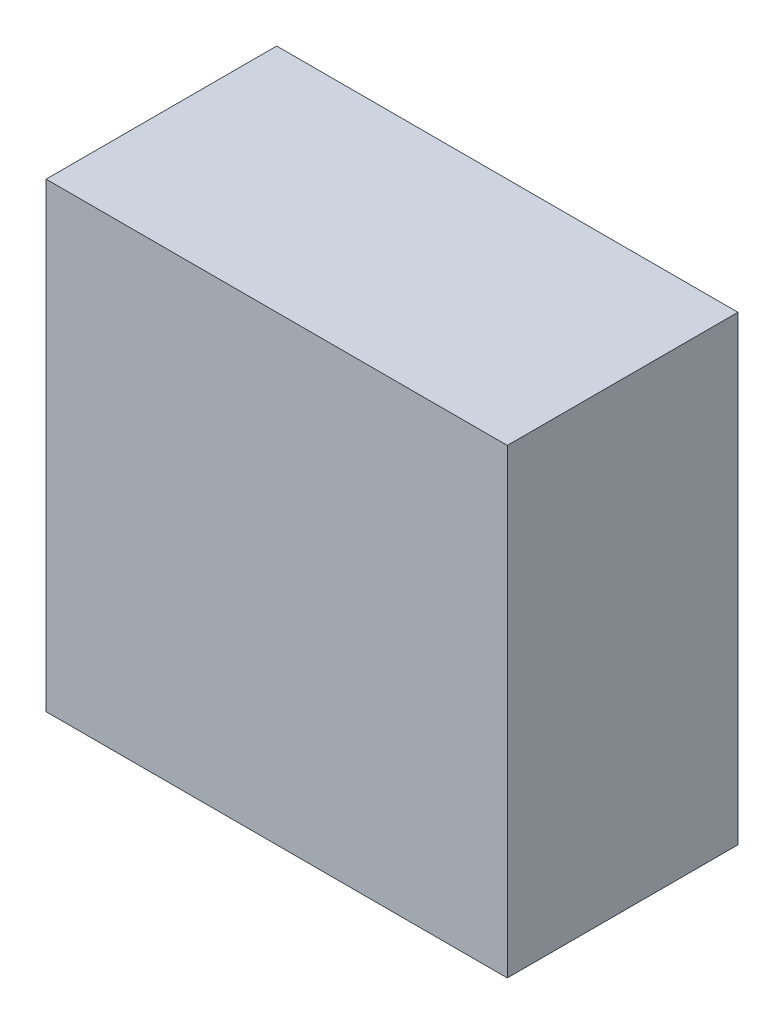
ISO-10303-21;
HEADER;
FILE_DESCRIPTION(('STEP AP214'),'2;1');
FILE_NAME('part.step','',(''),(''),'','','');
FILE_SCHEMA(('AUTOMOTIVE_DESIGN { 1 0 10303 214 1 1 1 1 }'));
ENDSEC;
DATA;
#1=APPLICATION_CONTEXT('core data for automotive mechanical design processes');
#2=APPLICATION_PROTOCOL_DEFINITION('international standard','automotive_design',2000,#1);
#3=PRODUCT_CONTEXT('',#1,'mechanical');
#4=PRODUCT('Part','Part','',(#3));
#5=PRODUCT_RELATED_PRODUCT_CATEGORY('part','',(#4));
#6=PRODUCT_DEFINITION_FORMATION('','',#4);
#7=PRODUCT_DEFINITION_CONTEXT('part definition',#1,'design');
#8=PRODUCT_DEFINITION('design','',#6,#7);
#9=PRODUCT_DEFINITION_SHAPE('','',#8);
#10=(LENGTH_UNIT() NAMED_UNIT(*) SI_UNIT(.MILLI.,.METRE.));
#11=(NAMED_UNIT(*) PLANE_ANGLE_UNIT() SI_UNIT($,.RADIAN.));
#12=(NAMED_UNIT(*) SI_UNIT($,.STERADIAN.) SOLID_ANGLE_UNIT());
#13=UNCERTAINTY_MEASURE_WITH_UNIT(LENGTH_MEASURE(1.E-05),#10,'distance_accuracy_value','');
#14=(GEOMETRIC_REPRESENTATION_CONTEXT(3) GLOBAL_UNCERTAINTY_ASSIGNED_CONTEXT((#13)) GLOBAL_UNIT_ASSIGNED_CONTEXT((#10,
#11,#12)) REPRESENTATION_CONTEXT('',''));
#15=CARTESIAN_POINT('',(0.,0.,0.));
#16=DIRECTION('',(0.,0.,1.));
#17=DIRECTION('',(1.,0.,0.));
#18=AXIS2_PLACEMENT_3D('',#15,#16,#17);
#19=CARTESIAN_POINT('',(0.,0.,2.75));
#20=DIRECTION('',(0.,0.,-1.));
#21=DIRECTION('',(-1.,0.,0.));
#22=AXIS2_PLACEMENT_3D('',#19,#20,#21);
#23=PLANE('',#22);
#24=DIRECTION('',(1.,0.,0.));
#25=VECTOR('',#24,1.);
#26=CARTESIAN_POINT('',(-78.,165.941489418563,2.75));
#27=LINE('',#26,#25);
#28=CARTESIAN_POINT('',(-82.,165.941489418563,2.75));
#29=VERTEX_POINT('',#28);
#30=CARTESIAN_POINT('',(-78.,165.941489418563,2.75));
#31=VERTEX_POINT('',#30);
#32=EDGE_CURVE('E80',#29,#31,#27,.T.);
#33=ORIENTED_EDGE('',*,*,#32,.T.);
#34=DIRECTION('',(0.,1.,0.));
#35=VECTOR('',#34,1.);
#36=CARTESIAN_POINT('',(-78.,169.941489418563,2.75));
#37=LINE('',#36,#35);
#38=CARTESIAN_POINT('',(-78.,169.941489418563,2.75));
#39=VERTEX_POINT('',#38);
#40=EDGE_CURVE('E55',#31,#39,#37,.T.);
#41=ORIENTED_EDGE('',*,*,#40,.T.);
#42=DIRECTION('',(1.,0.,0.));
#43=VECTOR('',#42,1.);
#44=CARTESIAN_POINT('',(-78.,169.941489418563,2.75));
#45=LINE('',#44,#43);
#46=CARTESIAN_POINT('',(-82.,169.941489418563,2.75));
#47=VERTEX_POINT('',#46);
#48=EDGE_CURVE('E57',#39,#47,#45,.F.);
#49=ORIENTED_EDGE('',*,*,#48,.T.);
#50=DIRECTION('',(0.,1.,0.));
#51=VECTOR('',#50,1.);
#52=CARTESIAN_POINT('',(-82.,169.941489418563,2.75));
#53=LINE('',#52,#51);
#54=EDGE_CURVE('E20',#47,#29,#53,.F.);
#55=ORIENTED_EDGE('',*,*,#54,.T.);
#56=EDGE_LOOP('',(#33,#41,#49,#55));
#57=FACE_BOUND('',#56,.T.);
#58=ADVANCED_FACE('F17',(#57),#23,.F.);
#59=CARTESIAN_POINT('',(-82.,169.941489418563,2.75));
#60=DIRECTION('',(1.,0.,0.));
#61=DIRECTION('',(0.,0.,-1.));
#62=AXIS2_PLACEMENT_3D('',#59,#60,#61);
#63=PLANE('',#62);
#64=DIRECTION('',(0.,0.,1.));
#65=VECTOR('',#64,1.);
#66=CARTESIAN_POINT('',(-82.,165.941489418563,2.75));
#67=LINE('',#66,#65);
#68=CARTESIAN_POINT('',(-82.,165.941489418563,0.75));
#69=VERTEX_POINT('',#68);
#70=EDGE_CURVE('E68',#69,#29,#67,.T.);
#71=ORIENTED_EDGE('',*,*,#70,.T.);
#72=ORIENTED_EDGE('',*,*,#54,.F.);
#73=DIRECTION('',(0.,0.,-1.));
#74=VECTOR('',#73,1.);
#75=CARTESIAN_POINT('',(-82.,169.941489418563,2.75));
#76=LINE('',#75,#74);
#77=CARTESIAN_POINT('',(-82.,169.941489418563,0.75));
#78=VERTEX_POINT('',#77);
#79=EDGE_CURVE('E63',#47,#78,#76,.T.);
#80=ORIENTED_EDGE('',*,*,#79,.T.);
#81=DIRECTION('',(0.,1.,0.));
#82=VECTOR('',#81,1.);
#83=CARTESIAN_POINT('',(-82.,0.,0.75));
#84=LINE('',#83,#82);
#85=EDGE_CURVE('E83',#69,#78,#84,.T.);
#86=ORIENTED_EDGE('',*,*,#85,.F.);
#87=EDGE_LOOP('',(#71,#72,#80,#86));
#88=FACE_BOUND('',#87,.T.);
#89=ADVANCED_FACE('F65',(#88),#63,.F.);
#90=CARTESIAN_POINT('',(-78.,169.941489418563,2.75));
#91=DIRECTION('',(0.,-1.,0.));
#92=DIRECTION('',(0.,0.,-1.));
#93=AXIS2_PLACEMENT_3D('',#90,#91,#92);
#94=PLANE('',#93);
#95=ORIENTED_EDGE('',*,*,#79,.F.);
#96=ORIENTED_EDGE('',*,*,#48,.F.);
#97=DIRECTION('',(0.,0.,1.));
#98=VECTOR('',#97,1.);
#99=CARTESIAN_POINT('',(-78.,169.941489418563,2.75));
#100=LINE('',#99,#98);
#101=CARTESIAN_POINT('',(-78.,169.941489418563,0.75));
#102=VERTEX_POINT('',#101);
#103=EDGE_CURVE('E75',#39,#102,#100,.F.);
#104=ORIENTED_EDGE('',*,*,#103,.T.);
#105=DIRECTION('',(-1.,0.,0.));
#106=VECTOR('',#105,1.);
#107=CARTESIAN_POINT('',(0.,169.941489418563,0.75));
#108=LINE('',#107,#106);
#109=EDGE_CURVE('E72',#78,#102,#108,.F.);
#110=ORIENTED_EDGE('',*,*,#109,.F.);
#111=EDGE_LOOP('',(#95,#96,#104,#110));
#112=FACE_BOUND('',#111,.T.);
#113=ADVANCED_FACE('F70',(#112),#94,.F.);
#114=CARTESIAN_POINT('',(-78.,169.941489418563,2.75));
#115=DIRECTION('',(-1.,0.,0.));
#116=DIRECTION('',(0.,0.,1.));
#117=AXIS2_PLACEMENT_3D('',#114,#115,#116);
#118=PLANE('',#117);
#119=ORIENTED_EDGE('',*,*,#103,.F.);
#120=ORIENTED_EDGE('',*,*,#40,.F.);
#121=DIRECTION('',(0.,0.,1.));
#122=VECTOR('',#121,1.);
#123=CARTESIAN_POINT('',(-78.,165.941489418563,2.75));
#124=LINE('',#123,#122);
#125=CARTESIAN_POINT('',(-78.,165.941489418563,0.75));
#126=VERTEX_POINT('',#125);
#127=EDGE_CURVE('E35',#31,#126,#124,.F.);
#128=ORIENTED_EDGE('',*,*,#127,.T.);
#129=DIRECTION('',(0.,1.,0.));
#130=VECTOR('',#129,1.);
#131=CARTESIAN_POINT('',(-78.,0.,0.75));
#132=LINE('',#131,#130);
#133=EDGE_CURVE('E26',#102,#126,#132,.F.);
#134=ORIENTED_EDGE('',*,*,#133,.F.);
#135=EDGE_LOOP('',(#119,#120,#128,#134));
#136=FACE_BOUND('',#135,.T.);
#137=ADVANCED_FACE('F89',(#136),#118,.F.);
#138=CARTESIAN_POINT('',(-78.,165.941489418563,2.75));
#139=DIRECTION('',(0.,1.,0.));
#140=DIRECTION('',(0.,0.,1.));
#141=AXIS2_PLACEMENT_3D('',#138,#139,#140);
#142=PLANE('',#141);
#143=ORIENTED_EDGE('',*,*,#127,.F.);
#144=ORIENTED_EDGE('',*,*,#32,.F.);
#145=ORIENTED_EDGE('',*,*,#70,.F.);
#146=DIRECTION('',(-1.,0.,0.));
#147=VECTOR('',#146,1.);
#148=CARTESIAN_POINT('',(0.,165.941489418563,0.75));
#149=LINE('',#148,#147);
#150=EDGE_CURVE('E11',#126,#69,#149,.T.);
#151=ORIENTED_EDGE('',*,*,#150,.F.);
#152=EDGE_LOOP('',(#143,#144,#145,#151));
#153=FACE_BOUND('',#152,.T.);
#154=ADVANCED_FACE('F91',(#153),#142,.F.);
#155=CARTESIAN_POINT('',(0.,0.,0.75));
#156=DIRECTION('',(0.,0.,-1.));
#157=DIRECTION('',(-1.,0.,0.));
#158=AXIS2_PLACEMENT_3D('',#155,#156,#157);
#159=PLANE('',#158);
#160=ORIENTED_EDGE('',*,*,#133,.T.);
#161=ORIENTED_EDGE('',*,*,#150,.T.);
#162=ORIENTED_EDGE('',*,*,#85,.T.);
#163=ORIENTED_EDGE('',*,*,#109,.T.);
#164=EDGE_LOOP('',(#160,#161,#162,#163));
#165=FACE_BOUND('',#164,.T.);
#166=ADVANCED_FACE('F88',(#165),#159,.T.);
#167=CLOSED_SHELL('',(#58,#89,#113,#137,#154,#166));
#168=MANIFOLD_SOLID_BREP('B1',#167);
#169=ADVANCED_BREP_SHAPE_REPRESENTATION('',(#18,#168),#14);
#170=SHAPE_DEFINITION_REPRESENTATION(#9,#169);
ENDSEC;
END-ISO-10303-21;
